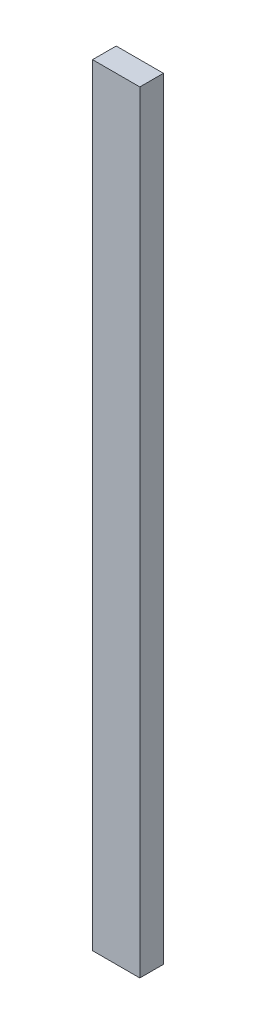
ISO-10303-21;
HEADER;
FILE_DESCRIPTION(('STEP AP214'),'2;1');
FILE_NAME('part.step','',(''),(''),'','','');
FILE_SCHEMA(('AUTOMOTIVE_DESIGN { 1 0 10303 214 1 1 1 1 }'));
ENDSEC;
DATA;
#1=APPLICATION_CONTEXT('core data for automotive mechanical design processes');
#2=APPLICATION_PROTOCOL_DEFINITION('international standard','automotive_design',2000,#1);
#3=PRODUCT_CONTEXT('',#1,'mechanical');
#4=PRODUCT('Part','Part','',(#3));
#5=PRODUCT_RELATED_PRODUCT_CATEGORY('part','',(#4));
#6=PRODUCT_DEFINITION_FORMATION('','',#4);
#7=PRODUCT_DEFINITION_CONTEXT('part definition',#1,'design');
#8=PRODUCT_DEFINITION('design','',#6,#7);
#9=PRODUCT_DEFINITION_SHAPE('','',#8);
#10=(LENGTH_UNIT() NAMED_UNIT(*) SI_UNIT(.MILLI.,.METRE.));
#11=(NAMED_UNIT(*) PLANE_ANGLE_UNIT() SI_UNIT($,.RADIAN.));
#12=(NAMED_UNIT(*) SI_UNIT($,.STERADIAN.) SOLID_ANGLE_UNIT());
#13=UNCERTAINTY_MEASURE_WITH_UNIT(LENGTH_MEASURE(1.E-05),#10,'distance_accuracy_value','');
#14=(GEOMETRIC_REPRESENTATION_CONTEXT(3) GLOBAL_UNCERTAINTY_ASSIGNED_CONTEXT((#13)) GLOBAL_UNIT_ASSIGNED_CONTEXT((#10,
#11,#12)) REPRESENTATION_CONTEXT('',''));
#15=CARTESIAN_POINT('',(0.,0.,0.));
#16=DIRECTION('',(0.,0.,1.));
#17=DIRECTION('',(1.,0.,0.));
#18=AXIS2_PLACEMENT_3D('',#15,#16,#17);
#19=CARTESIAN_POINT('',(0.,490.,0.));
#20=DIRECTION('',(1.,0.,0.));
#21=DIRECTION('',(0.,0.,-1.));
#22=AXIS2_PLACEMENT_3D('',#19,#20,#21);
#23=PLANE('',#22);
#24=DIRECTION('',(0.,0.,1.));
#25=VECTOR('',#24,1.);
#26=CARTESIAN_POINT('',(0.,0.,0.));
#27=LINE('',#26,#25);
#28=CARTESIAN_POINT('',(0.,0.,-15.));
#29=VERTEX_POINT('',#28);
#30=CARTESIAN_POINT('',(0.,0.,0.));
#31=VERTEX_POINT('',#30);
#32=EDGE_CURVE('E107',#29,#31,#27,.T.);
#33=ORIENTED_EDGE('',*,*,#32,.T.);
#34=DIRECTION('',(0.,-1.,0.));
#35=VECTOR('',#34,1.);
#36=CARTESIAN_POINT('',(0.,490.,0.));
#37=LINE('',#36,#35);
#38=CARTESIAN_POINT('',(0.,490.,0.));
#39=VERTEX_POINT('',#38);
#40=EDGE_CURVE('E11',#39,#31,#37,.T.);
#41=ORIENTED_EDGE('',*,*,#40,.F.);
#42=DIRECTION('',(0.,0.,1.));
#43=VECTOR('',#42,1.);
#44=CARTESIAN_POINT('',(0.,490.,0.));
#45=LINE('',#44,#43);
#46=CARTESIAN_POINT('',(0.,490.,-15.));
#47=VERTEX_POINT('',#46);
#48=EDGE_CURVE('E91',#47,#39,#45,.T.);
#49=ORIENTED_EDGE('',*,*,#48,.F.);
#50=DIRECTION('',(0.,-1.,0.));
#51=VECTOR('',#50,1.);
#52=CARTESIAN_POINT('',(0.,490.,-15.));
#53=LINE('',#52,#51);
#54=EDGE_CURVE('E103',#47,#29,#53,.T.);
#55=ORIENTED_EDGE('',*,*,#54,.T.);
#56=EDGE_LOOP('',(#33,#41,#49,#55));
#57=FACE_BOUND('',#56,.T.);
#58=ADVANCED_FACE('F39',(#57),#23,.F.);
#59=CARTESIAN_POINT('',(0.,490.,0.));
#60=DIRECTION('',(0.,0.,-1.));
#61=DIRECTION('',(-1.,0.,0.));
#62=AXIS2_PLACEMENT_3D('',#59,#60,#61);
#63=PLANE('',#62);
#64=DIRECTION('',(1.,0.,0.));
#65=VECTOR('',#64,1.);
#66=CARTESIAN_POINT('',(0.,0.,0.));
#67=LINE('',#66,#65);
#68=CARTESIAN_POINT('',(30.,0.,0.));
#69=VERTEX_POINT('',#68);
#70=EDGE_CURVE('E96',#31,#69,#67,.T.);
#71=ORIENTED_EDGE('',*,*,#70,.T.);
#72=DIRECTION('',(0.,-1.,0.));
#73=VECTOR('',#72,1.);
#74=CARTESIAN_POINT('',(30.,490.,0.));
#75=LINE('',#74,#73);
#76=CARTESIAN_POINT('',(30.,490.,0.));
#77=VERTEX_POINT('',#76);
#78=EDGE_CURVE('E48',#77,#69,#75,.T.);
#79=ORIENTED_EDGE('',*,*,#78,.F.);
#80=DIRECTION('',(1.,0.,0.));
#81=VECTOR('',#80,1.);
#82=CARTESIAN_POINT('',(0.,490.,0.));
#83=LINE('',#82,#81);
#84=EDGE_CURVE('E86',#39,#77,#83,.T.);
#85=ORIENTED_EDGE('',*,*,#84,.F.);
#86=ORIENTED_EDGE('',*,*,#40,.T.);
#87=EDGE_LOOP('',(#71,#79,#85,#86));
#88=FACE_BOUND('',#87,.T.);
#89=ADVANCED_FACE('F95',(#88),#63,.F.);
#90=CARTESIAN_POINT('',(30.,490.,0.));
#91=DIRECTION('',(-1.,0.,0.));
#92=DIRECTION('',(0.,0.,1.));
#93=AXIS2_PLACEMENT_3D('',#90,#91,#92);
#94=PLANE('',#93);
#95=DIRECTION('',(0.,0.,-1.));
#96=VECTOR('',#95,1.);
#97=CARTESIAN_POINT('',(30.,0.,0.));
#98=LINE('',#97,#96);
#99=CARTESIAN_POINT('',(30.,0.,-15.));
#100=VERTEX_POINT('',#99);
#101=EDGE_CURVE('E73',#69,#100,#98,.T.);
#102=ORIENTED_EDGE('',*,*,#101,.T.);
#103=DIRECTION('',(0.,-1.,0.));
#104=VECTOR('',#103,1.);
#105=CARTESIAN_POINT('',(30.,490.,-15.));
#106=LINE('',#105,#104);
#107=CARTESIAN_POINT('',(30.,490.,-15.));
#108=VERTEX_POINT('',#107);
#109=EDGE_CURVE('E98',#108,#100,#106,.T.);
#110=ORIENTED_EDGE('',*,*,#109,.F.);
#111=DIRECTION('',(0.,0.,-1.));
#112=VECTOR('',#111,1.);
#113=CARTESIAN_POINT('',(30.,490.,0.));
#114=LINE('',#113,#112);
#115=EDGE_CURVE('E89',#77,#108,#114,.T.);
#116=ORIENTED_EDGE('',*,*,#115,.F.);
#117=ORIENTED_EDGE('',*,*,#78,.T.);
#118=EDGE_LOOP('',(#102,#110,#116,#117));
#119=FACE_BOUND('',#118,.T.);
#120=ADVANCED_FACE('F99',(#119),#94,.F.);
#121=CARTESIAN_POINT('',(0.,490.,-15.));
#122=DIRECTION('',(0.,0.,1.));
#123=DIRECTION('',(1.,0.,0.));
#124=AXIS2_PLACEMENT_3D('',#121,#122,#123);
#125=PLANE('',#124);
#126=DIRECTION('',(-1.,0.,0.));
#127=VECTOR('',#126,1.);
#128=CARTESIAN_POINT('',(0.,0.,-15.));
#129=LINE('',#128,#127);
#130=EDGE_CURVE('E79',#100,#29,#129,.T.);
#131=ORIENTED_EDGE('',*,*,#130,.T.);
#132=ORIENTED_EDGE('',*,*,#54,.F.);
#133=DIRECTION('',(-1.,0.,0.));
#134=VECTOR('',#133,1.);
#135=CARTESIAN_POINT('',(0.,490.,-15.));
#136=LINE('',#135,#134);
#137=EDGE_CURVE('E56',#108,#47,#136,.T.);
#138=ORIENTED_EDGE('',*,*,#137,.F.);
#139=ORIENTED_EDGE('',*,*,#109,.T.);
#140=EDGE_LOOP('',(#131,#132,#138,#139));
#141=FACE_BOUND('',#140,.T.);
#142=ADVANCED_FACE('F120',(#141),#125,.F.);
#143=CARTESIAN_POINT('',(0.,490.,0.));
#144=DIRECTION('',(0.,-1.,0.));
#145=DIRECTION('',(0.,0.,-1.));
#146=AXIS2_PLACEMENT_3D('',#143,#144,#145);
#147=PLANE('',#146);
#148=ORIENTED_EDGE('',*,*,#48,.T.);
#149=ORIENTED_EDGE('',*,*,#84,.T.);
#150=ORIENTED_EDGE('',*,*,#115,.T.);
#151=ORIENTED_EDGE('',*,*,#137,.T.);
#152=EDGE_LOOP('',(#148,#149,#150,#151));
#153=FACE_BOUND('',#152,.T.);
#154=ADVANCED_FACE('F87',(#153),#147,.F.);
#155=CARTESIAN_POINT('',(0.,0.,0.));
#156=DIRECTION('',(0.,-1.,0.));
#157=DIRECTION('',(0.,0.,-1.));
#158=AXIS2_PLACEMENT_3D('',#155,#156,#157);
#159=PLANE('',#158);
#160=ORIENTED_EDGE('',*,*,#32,.F.);
#161=ORIENTED_EDGE('',*,*,#130,.F.);
#162=ORIENTED_EDGE('',*,*,#101,.F.);
#163=ORIENTED_EDGE('',*,*,#70,.F.);
#164=EDGE_LOOP('',(#160,#161,#162,#163));
#165=FACE_BOUND('',#164,.T.);
#166=ADVANCED_FACE('F123',(#165),#159,.T.);
#167=CLOSED_SHELL('',(#58,#89,#120,#142,#154,#166));
#168=MANIFOLD_SOLID_BREP('B2',#167);
#169=ADVANCED_BREP_SHAPE_REPRESENTATION('',(#18,#168),#14);
#170=SHAPE_DEFINITION_REPRESENTATION(#9,#169);
ENDSEC;
END-ISO-10303-21;
